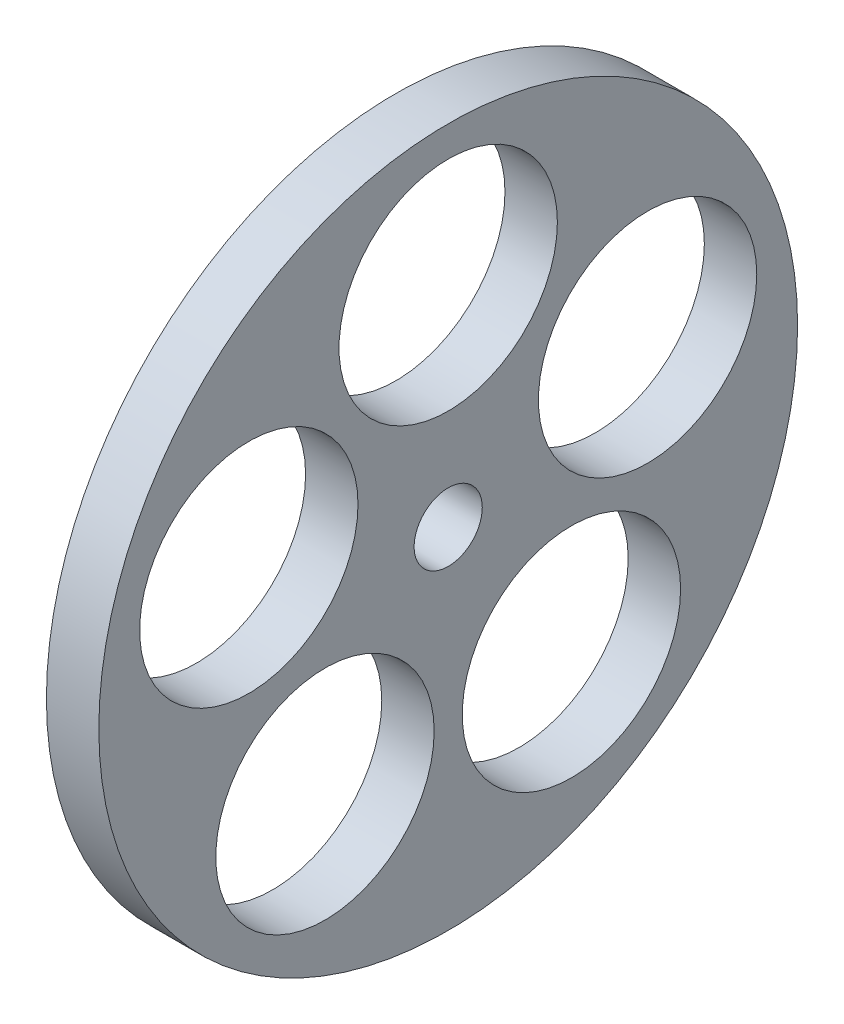
ISO-10303-21;
HEADER;
FILE_DESCRIPTION(('STEP AP214'),'2;1');
FILE_NAME('part.step','',(''),(''),'','','');
FILE_SCHEMA(('AUTOMOTIVE_DESIGN { 1 0 10303 214 1 1 1 1 }'));
ENDSEC;
DATA;
#1=APPLICATION_CONTEXT('core data for automotive mechanical design processes');
#2=APPLICATION_PROTOCOL_DEFINITION('international standard','automotive_design',2000,#1);
#3=PRODUCT_CONTEXT('',#1,'mechanical');
#4=PRODUCT('Part','Part','',(#3));
#5=PRODUCT_RELATED_PRODUCT_CATEGORY('part','',(#4));
#6=PRODUCT_DEFINITION_FORMATION('','',#4);
#7=PRODUCT_DEFINITION_CONTEXT('part definition',#1,'design');
#8=PRODUCT_DEFINITION('design','',#6,#7);
#9=PRODUCT_DEFINITION_SHAPE('','',#8);
#10=(LENGTH_UNIT() NAMED_UNIT(*) SI_UNIT(.MILLI.,.METRE.));
#11=(NAMED_UNIT(*) PLANE_ANGLE_UNIT() SI_UNIT($,.RADIAN.));
#12=(NAMED_UNIT(*) SI_UNIT($,.STERADIAN.) SOLID_ANGLE_UNIT());
#13=UNCERTAINTY_MEASURE_WITH_UNIT(LENGTH_MEASURE(1.E-05),#10,'distance_accuracy_value','');
#14=(GEOMETRIC_REPRESENTATION_CONTEXT(3) GLOBAL_UNCERTAINTY_ASSIGNED_CONTEXT((#13)) GLOBAL_UNIT_ASSIGNED_CONTEXT((#10,
#11,#12)) REPRESENTATION_CONTEXT('',''));
#15=CARTESIAN_POINT('',(0.,0.,0.));
#16=DIRECTION('',(0.,0.,1.));
#17=DIRECTION('',(1.,0.,0.));
#18=AXIS2_PLACEMENT_3D('',#15,#16,#17);
#19=CARTESIAN_POINT('',(6.,0.,0.));
#20=DIRECTION('',(1.,0.,0.));
#21=DIRECTION('',(0.,0.,-1.));
#22=AXIS2_PLACEMENT_3D('',#19,#20,#21);
#23=PLANE('',#22);
#24=CARTESIAN_POINT('',(6.,-19.4164078649992,14.1068460550181));
#25=DIRECTION('',(1.,0.,0.));
#26=DIRECTION('',(0.,0.,-1.));
#27=AXIS2_PLACEMENT_3D('',#24,#25,#26);
#28=CIRCLE('',#27,12.5);
#29=CARTESIAN_POINT('',(6.,-19.4164078649992,1.60684605501805));
#30=VERTEX_POINT('',#29);
#31=EDGE_CURVE('E112',#30,#30,#28,.T.);
#32=ORIENTED_EDGE('',*,*,#31,.F.);
#33=EDGE_LOOP('',(#32));
#34=FACE_BOUND('',#33,.T.);
#35=CARTESIAN_POINT('',(6.,7.41640786499943,-22.8253563910842));
#36=DIRECTION('',(1.,0.,0.));
#37=DIRECTION('',(0.,0.,-1.));
#38=AXIS2_PLACEMENT_3D('',#35,#36,#37);
#39=CIRCLE('',#38,12.5);
#40=CARTESIAN_POINT('',(6.,7.41640786499943,-35.3253563910842));
#41=VERTEX_POINT('',#40);
#42=EDGE_CURVE('E77',#41,#41,#39,.T.);
#43=ORIENTED_EDGE('',*,*,#42,.F.);
#44=EDGE_LOOP('',(#43));
#45=FACE_BOUND('',#44,.T.);
#46=CARTESIAN_POINT('',(6.,0.,0.));
#47=DIRECTION('',(1.,0.,0.));
#48=DIRECTION('',(0.,0.,-1.));
#49=AXIS2_PLACEMENT_3D('',#46,#47,#48);
#50=CIRCLE('',#49,3.9);
#51=CARTESIAN_POINT('',(6.,0.,-3.9));
#52=VERTEX_POINT('',#51);
#53=EDGE_CURVE('E55',#52,#52,#50,.T.);
#54=ORIENTED_EDGE('',*,*,#53,.F.);
#55=EDGE_LOOP('',(#54));
#56=FACE_BOUND('',#55,.T.);
#57=CARTESIAN_POINT('',(6.,0.,0.));
#58=DIRECTION('',(1.,0.,0.));
#59=DIRECTION('',(0.,0.,-1.));
#60=AXIS2_PLACEMENT_3D('',#57,#58,#59);
#61=CIRCLE('',#60,40.);
#62=CARTESIAN_POINT('',(6.,0.,-40.));
#63=VERTEX_POINT('',#62);
#64=EDGE_CURVE('E11',#63,#63,#61,.T.);
#65=ORIENTED_EDGE('',*,*,#64,.T.);
#66=EDGE_LOOP('',(#65));
#67=FACE_BOUND('',#66,.T.);
#68=CARTESIAN_POINT('',(6.,24.,0.));
#69=DIRECTION('',(1.,0.,0.));
#70=DIRECTION('',(0.,0.,-1.));
#71=AXIS2_PLACEMENT_3D('',#68,#69,#70);
#72=CIRCLE('',#71,12.5);
#73=CARTESIAN_POINT('',(6.,24.,-12.5));
#74=VERTEX_POINT('',#73);
#75=EDGE_CURVE('E66',#74,#74,#72,.T.);
#76=ORIENTED_EDGE('',*,*,#75,.F.);
#77=EDGE_LOOP('',(#76));
#78=FACE_BOUND('',#77,.T.);
#79=CARTESIAN_POINT('',(6.,-19.4164078649983,-14.1068460550207));
#80=DIRECTION('',(1.,0.,0.));
#81=DIRECTION('',(0.,0.,-1.));
#82=AXIS2_PLACEMENT_3D('',#79,#80,#81);
#83=CIRCLE('',#82,12.5);
#84=CARTESIAN_POINT('',(6.,-19.4164078649983,-26.6068460550207));
#85=VERTEX_POINT('',#84);
#86=EDGE_CURVE('E122',#85,#85,#83,.T.);
#87=ORIENTED_EDGE('',*,*,#86,.F.);
#88=EDGE_LOOP('',(#87));
#89=FACE_BOUND('',#88,.T.);
#90=CARTESIAN_POINT('',(6.,7.41640786499805,22.8253563910832));
#91=DIRECTION('',(1.,0.,0.));
#92=DIRECTION('',(0.,0.,-1.));
#93=AXIS2_PLACEMENT_3D('',#90,#91,#92);
#94=CIRCLE('',#93,12.5);
#95=CARTESIAN_POINT('',(6.,7.41640786499805,10.3253563910832));
#96=VERTEX_POINT('',#95);
#97=EDGE_CURVE('E125',#96,#96,#94,.T.);
#98=ORIENTED_EDGE('',*,*,#97,.F.);
#99=EDGE_LOOP('',(#98));
#100=FACE_BOUND('',#99,.T.);
#101=ADVANCED_FACE('F42',(#34,#45,#56,#67,#78,#89,#100),#23,.T.);
#102=CARTESIAN_POINT('',(0.,0.,0.));
#103=DIRECTION('',(1.,0.,0.));
#104=DIRECTION('',(0.,0.,-1.));
#105=AXIS2_PLACEMENT_3D('',#102,#103,#104);
#106=PLANE('',#105);
#107=CARTESIAN_POINT('',(0.,0.,0.));
#108=DIRECTION('',(1.,0.,0.));
#109=DIRECTION('',(0.,0.,-1.));
#110=AXIS2_PLACEMENT_3D('',#107,#108,#109);
#111=CIRCLE('',#110,40.);
#112=CARTESIAN_POINT('',(0.,0.,-40.));
#113=VERTEX_POINT('',#112);
#114=EDGE_CURVE('E46',#113,#113,#111,.T.);
#115=ORIENTED_EDGE('',*,*,#114,.F.);
#116=EDGE_LOOP('',(#115));
#117=FACE_BOUND('',#116,.T.);
#118=CARTESIAN_POINT('',(0.,0.,0.));
#119=DIRECTION('',(1.,0.,0.));
#120=DIRECTION('',(0.,0.,-1.));
#121=AXIS2_PLACEMENT_3D('',#118,#119,#120);
#122=CIRCLE('',#121,3.9);
#123=CARTESIAN_POINT('',(0.,0.,-3.9));
#124=VERTEX_POINT('',#123);
#125=EDGE_CURVE('E58',#124,#124,#122,.T.);
#126=ORIENTED_EDGE('',*,*,#125,.T.);
#127=EDGE_LOOP('',(#126));
#128=FACE_BOUND('',#127,.T.);
#129=CARTESIAN_POINT('',(0.,24.,0.));
#130=DIRECTION('',(1.,0.,0.));
#131=DIRECTION('',(0.,0.,-1.));
#132=AXIS2_PLACEMENT_3D('',#129,#130,#131);
#133=CIRCLE('',#132,12.5);
#134=CARTESIAN_POINT('',(0.,24.,-12.5));
#135=VERTEX_POINT('',#134);
#136=EDGE_CURVE('E72',#135,#135,#133,.T.);
#137=ORIENTED_EDGE('',*,*,#136,.T.);
#138=EDGE_LOOP('',(#137));
#139=FACE_BOUND('',#138,.T.);
#140=CARTESIAN_POINT('',(0.,7.41640786499943,-22.8253563910842));
#141=DIRECTION('',(1.,0.,0.));
#142=DIRECTION('',(0.,0.,-1.));
#143=AXIS2_PLACEMENT_3D('',#140,#141,#142);
#144=CIRCLE('',#143,12.5);
#145=CARTESIAN_POINT('',(0.,7.41640786499943,-35.3253563910842));
#146=VERTEX_POINT('',#145);
#147=EDGE_CURVE('E73',#146,#146,#144,.T.);
#148=ORIENTED_EDGE('',*,*,#147,.T.);
#149=EDGE_LOOP('',(#148));
#150=FACE_BOUND('',#149,.T.);
#151=CARTESIAN_POINT('',(0.,-19.4164078649983,-14.1068460550207));
#152=DIRECTION('',(1.,0.,0.));
#153=DIRECTION('',(0.,0.,-1.));
#154=AXIS2_PLACEMENT_3D('',#151,#152,#153);
#155=CIRCLE('',#154,12.5);
#156=CARTESIAN_POINT('',(0.,-19.4164078649983,-26.6068460550207));
#157=VERTEX_POINT('',#156);
#158=EDGE_CURVE('E140',#157,#157,#155,.T.);
#159=ORIENTED_EDGE('',*,*,#158,.T.);
#160=EDGE_LOOP('',(#159));
#161=FACE_BOUND('',#160,.T.);
#162=CARTESIAN_POINT('',(0.,-19.4164078649992,14.1068460550181));
#163=DIRECTION('',(1.,0.,0.));
#164=DIRECTION('',(0.,0.,-1.));
#165=AXIS2_PLACEMENT_3D('',#162,#163,#164);
#166=CIRCLE('',#165,12.5);
#167=CARTESIAN_POINT('',(0.,-19.4164078649992,1.60684605501805));
#168=VERTEX_POINT('',#167);
#169=EDGE_CURVE('E128',#168,#168,#166,.T.);
#170=ORIENTED_EDGE('',*,*,#169,.T.);
#171=EDGE_LOOP('',(#170));
#172=FACE_BOUND('',#171,.T.);
#173=CARTESIAN_POINT('',(0.,7.41640786499805,22.8253563910832));
#174=DIRECTION('',(1.,0.,0.));
#175=DIRECTION('',(0.,0.,-1.));
#176=AXIS2_PLACEMENT_3D('',#173,#174,#175);
#177=CIRCLE('',#176,12.5);
#178=CARTESIAN_POINT('',(0.,7.41640786499805,10.3253563910832));
#179=VERTEX_POINT('',#178);
#180=EDGE_CURVE('E129',#179,#179,#177,.T.);
#181=ORIENTED_EDGE('',*,*,#180,.T.);
#182=EDGE_LOOP('',(#181));
#183=FACE_BOUND('',#182,.T.);
#184=ADVANCED_FACE('F87',(#117,#128,#139,#150,#161,#172,#183),#106,.F.);
#185=CARTESIAN_POINT('',(6.,0.,0.));
#186=DIRECTION('',(-1.,0.,0.));
#187=DIRECTION('',(0.,0.,1.));
#188=AXIS2_PLACEMENT_3D('',#185,#186,#187);
#189=CYLINDRICAL_SURFACE('',#188,40.);
#190=ORIENTED_EDGE('',*,*,#64,.F.);
#191=EDGE_LOOP('',(#190));
#192=FACE_BOUND('',#191,.T.);
#193=ORIENTED_EDGE('',*,*,#114,.T.);
#194=EDGE_LOOP('',(#193));
#195=FACE_BOUND('',#194,.T.);
#196=ADVANCED_FACE('F44',(#192,#195),#189,.T.);
#197=CARTESIAN_POINT('',(6.,0.,0.));
#198=DIRECTION('',(-1.,0.,0.));
#199=DIRECTION('',(0.,0.,1.));
#200=AXIS2_PLACEMENT_3D('',#197,#198,#199);
#201=CYLINDRICAL_SURFACE('',#200,3.9);
#202=ORIENTED_EDGE('',*,*,#53,.T.);
#203=EDGE_LOOP('',(#202));
#204=FACE_BOUND('',#203,.T.);
#205=ORIENTED_EDGE('',*,*,#125,.F.);
#206=EDGE_LOOP('',(#205));
#207=FACE_BOUND('',#206,.T.);
#208=ADVANCED_FACE('F90',(#204,#207),#201,.F.);
#209=CARTESIAN_POINT('',(6.,24.,0.));
#210=DIRECTION('',(-1.,0.,0.));
#211=DIRECTION('',(0.,0.,1.));
#212=AXIS2_PLACEMENT_3D('',#209,#210,#211);
#213=CYLINDRICAL_SURFACE('',#212,12.5);
#214=ORIENTED_EDGE('',*,*,#75,.T.);
#215=EDGE_LOOP('',(#214));
#216=FACE_BOUND('',#215,.T.);
#217=ORIENTED_EDGE('',*,*,#136,.F.);
#218=EDGE_LOOP('',(#217));
#219=FACE_BOUND('',#218,.T.);
#220=ADVANCED_FACE('F92',(#216,#219),#213,.F.);
#221=CARTESIAN_POINT('',(6.,7.41640786499943,-22.8253563910842));
#222=DIRECTION('',(-1.,0.,0.));
#223=DIRECTION('',(0.,0.,1.));
#224=AXIS2_PLACEMENT_3D('',#221,#222,#223);
#225=CYLINDRICAL_SURFACE('',#224,12.5);
#226=ORIENTED_EDGE('',*,*,#42,.T.);
#227=EDGE_LOOP('',(#226));
#228=FACE_BOUND('',#227,.T.);
#229=ORIENTED_EDGE('',*,*,#147,.F.);
#230=EDGE_LOOP('',(#229));
#231=FACE_BOUND('',#230,.T.);
#232=ADVANCED_FACE('F98',(#228,#231),#225,.F.);
#233=CARTESIAN_POINT('',(6.,-19.4164078649983,-14.1068460550207));
#234=DIRECTION('',(-1.,0.,0.));
#235=DIRECTION('',(0.,0.,1.));
#236=AXIS2_PLACEMENT_3D('',#233,#234,#235);
#237=CYLINDRICAL_SURFACE('',#236,12.5);
#238=ORIENTED_EDGE('',*,*,#86,.T.);
#239=EDGE_LOOP('',(#238));
#240=FACE_BOUND('',#239,.T.);
#241=ORIENTED_EDGE('',*,*,#158,.F.);
#242=EDGE_LOOP('',(#241));
#243=FACE_BOUND('',#242,.T.);
#244=ADVANCED_FACE('F157',(#240,#243),#237,.F.);
#245=CARTESIAN_POINT('',(6.,-19.4164078649992,14.1068460550181));
#246=DIRECTION('',(-1.,0.,0.));
#247=DIRECTION('',(0.,0.,1.));
#248=AXIS2_PLACEMENT_3D('',#245,#246,#247);
#249=CYLINDRICAL_SURFACE('',#248,12.5);
#250=ORIENTED_EDGE('',*,*,#31,.T.);
#251=EDGE_LOOP('',(#250));
#252=FACE_BOUND('',#251,.T.);
#253=ORIENTED_EDGE('',*,*,#169,.F.);
#254=EDGE_LOOP('',(#253));
#255=FACE_BOUND('',#254,.T.);
#256=ADVANCED_FACE('F163',(#252,#255),#249,.F.);
#257=CARTESIAN_POINT('',(6.,7.41640786499805,22.8253563910832));
#258=DIRECTION('',(-1.,0.,0.));
#259=DIRECTION('',(0.,0.,1.));
#260=AXIS2_PLACEMENT_3D('',#257,#258,#259);
#261=CYLINDRICAL_SURFACE('',#260,12.5);
#262=ORIENTED_EDGE('',*,*,#97,.T.);
#263=EDGE_LOOP('',(#262));
#264=FACE_BOUND('',#263,.T.);
#265=ORIENTED_EDGE('',*,*,#180,.F.);
#266=EDGE_LOOP('',(#265));
#267=FACE_BOUND('',#266,.T.);
#268=ADVANCED_FACE('F168',(#264,#267),#261,.F.);
#269=CLOSED_SHELL('',(#101,#184,#196,#208,#220,#232,#244,#256,#268));
#270=MANIFOLD_SOLID_BREP('B2',#269);
#271=ADVANCED_BREP_SHAPE_REPRESENTATION('',(#18,#270),#14);
#272=SHAPE_DEFINITION_REPRESENTATION(#9,#271);
ENDSEC;
END-ISO-10303-21;
